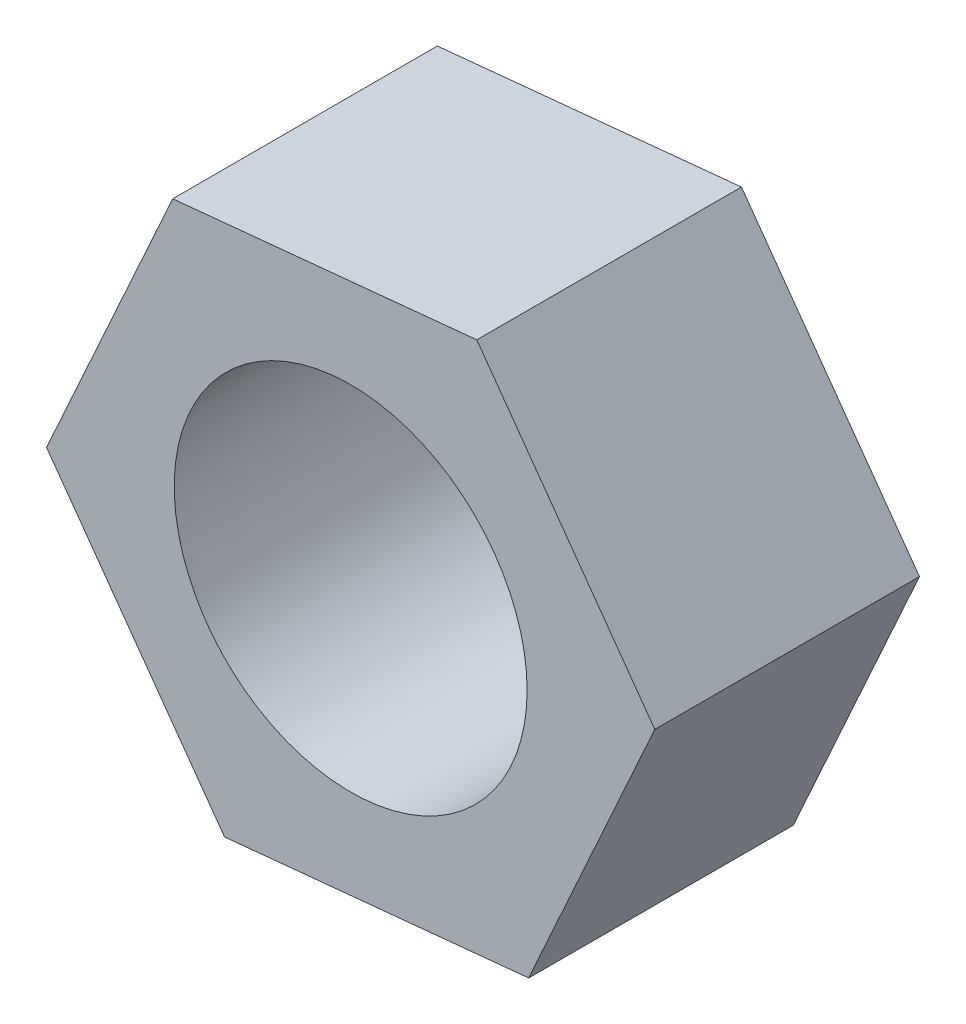
ISO-10303-21;
HEADER;
FILE_DESCRIPTION(('STEP AP214'),'2;1');
FILE_NAME('part.step','',(''),(''),'','','');
FILE_SCHEMA(('AUTOMOTIVE_DESIGN { 1 0 10303 214 1 1 1 1 }'));
ENDSEC;
DATA;
#1=APPLICATION_CONTEXT('core data for automotive mechanical design processes');
#2=APPLICATION_PROTOCOL_DEFINITION('international standard','automotive_design',2000,#1);
#3=PRODUCT_CONTEXT('',#1,'mechanical');
#4=PRODUCT('Part','Part','',(#3));
#5=PRODUCT_RELATED_PRODUCT_CATEGORY('part','',(#4));
#6=PRODUCT_DEFINITION_FORMATION('','',#4);
#7=PRODUCT_DEFINITION_CONTEXT('part definition',#1,'design');
#8=PRODUCT_DEFINITION('design','',#6,#7);
#9=PRODUCT_DEFINITION_SHAPE('','',#8);
#10=(LENGTH_UNIT() NAMED_UNIT(*) SI_UNIT(.MILLI.,.METRE.));
#11=(NAMED_UNIT(*) PLANE_ANGLE_UNIT() SI_UNIT($,.RADIAN.));
#12=(NAMED_UNIT(*) SI_UNIT($,.STERADIAN.) SOLID_ANGLE_UNIT());
#13=UNCERTAINTY_MEASURE_WITH_UNIT(LENGTH_MEASURE(1.E-05),#10,'distance_accuracy_value','');
#14=(GEOMETRIC_REPRESENTATION_CONTEXT(3) GLOBAL_UNCERTAINTY_ASSIGNED_CONTEXT((#13)) GLOBAL_UNIT_ASSIGNED_CONTEXT((#10,
#11,#12)) REPRESENTATION_CONTEXT('',''));
#15=CARTESIAN_POINT('',(0.,0.,0.));
#16=DIRECTION('',(0.,0.,1.));
#17=DIRECTION('',(1.,0.,0.));
#18=AXIS2_PLACEMENT_3D('',#15,#16,#17);
#19=CARTESIAN_POINT('',(0.,0.,15.));
#20=DIRECTION('',(0.,0.,1.));
#21=DIRECTION('',(1.,0.,0.));
#22=AXIS2_PLACEMENT_3D('',#19,#20,#21);
#23=PLANE('',#22);
#24=DIRECTION('',(0.99519247188162,0.0979384700214957,0.));
#25=VECTOR('',#24,1.);
#26=CARTESIAN_POINT('',(-7.14954257272269,-15.7760591086883,15.));
#27=LINE('',#26,#25);
#28=CARTESIAN_POINT('',(-7.14954257272269,-15.7760591086883,15.));
#29=VERTEX_POINT('',#28);
#30=CARTESIAN_POINT('',(10.0876966733676,-14.0797150477603,15.));
#31=VERTEX_POINT('',#30);
#32=EDGE_CURVE('E131',#29,#31,#27,.T.);
#33=ORIENTED_EDGE('',*,*,#32,.T.);
#34=DIRECTION('',(0.412779032894414,0.910831197315261,0.));
#35=VECTOR('',#34,1.);
#36=CARTESIAN_POINT('',(10.0876966733676,-14.0797150477603,15.));
#37=LINE('',#36,#35);
#38=CARTESIAN_POINT('',(17.2372392460903,1.69634406092792,15.));
#39=VERTEX_POINT('',#38);
#40=EDGE_CURVE('E89',#31,#39,#37,.T.);
#41=ORIENTED_EDGE('',*,*,#40,.T.);
#42=DIRECTION('',(-0.582413438987206,0.812892727293765,0.));
#43=VECTOR('',#42,1.);
#44=CARTESIAN_POINT('',(17.2372392460903,1.69634406092792,15.));
#45=LINE('',#44,#43);
#46=CARTESIAN_POINT('',(7.14954257272269,15.7760591086882,15.));
#47=VERTEX_POINT('',#46);
#48=EDGE_CURVE('E102',#39,#47,#45,.T.);
#49=ORIENTED_EDGE('',*,*,#48,.T.);
#50=DIRECTION('',(-0.99519247188162,-0.0979384700214954,0.));
#51=VECTOR('',#50,1.);
#52=CARTESIAN_POINT('',(7.14954257272269,15.7760591086882,15.));
#53=LINE('',#52,#51);
#54=CARTESIAN_POINT('',(-10.0876966733676,14.0797150477603,15.));
#55=VERTEX_POINT('',#54);
#56=EDGE_CURVE('E96',#47,#55,#53,.T.);
#57=ORIENTED_EDGE('',*,*,#56,.T.);
#58=DIRECTION('',(-0.412779032894414,-0.910831197315261,0.));
#59=VECTOR('',#58,1.);
#60=CARTESIAN_POINT('',(-10.0876966733676,14.0797150477603,15.));
#61=LINE('',#60,#59);
#62=CARTESIAN_POINT('',(-17.2372392460903,-1.69634406092792,15.));
#63=VERTEX_POINT('',#62);
#64=EDGE_CURVE('E100',#55,#63,#61,.T.);
#65=ORIENTED_EDGE('',*,*,#64,.T.);
#66=DIRECTION('',(0.582413438987206,-0.812892727293766,0.));
#67=VECTOR('',#66,1.);
#68=CARTESIAN_POINT('',(-17.2372392460903,-1.69634406092792,15.));
#69=LINE('',#68,#67);
#70=EDGE_CURVE('E52',#63,#29,#69,.T.);
#71=ORIENTED_EDGE('',*,*,#70,.T.);
#72=EDGE_LOOP('',(#33,#41,#49,#57,#65,#71));
#73=FACE_BOUND('',#72,.T.);
#74=CARTESIAN_POINT('',(0.,0.,15.));
#75=DIRECTION('',(0.,0.,1.));
#76=DIRECTION('',(1.,0.,0.));
#77=AXIS2_PLACEMENT_3D('',#74,#75,#76);
#78=CIRCLE('',#77,10.);
#79=CARTESIAN_POINT('',(10.,0.,15.));
#80=VERTEX_POINT('',#79);
#81=EDGE_CURVE('E124',#80,#80,#78,.T.);
#82=ORIENTED_EDGE('',*,*,#81,.F.);
#83=EDGE_LOOP('',(#82));
#84=FACE_BOUND('',#83,.T.);
#85=ADVANCED_FACE('F35',(#73,#84),#23,.T.);
#86=CARTESIAN_POINT('',(0.,0.,0.));
#87=DIRECTION('',(0.,0.,1.));
#88=DIRECTION('',(1.,0.,0.));
#89=AXIS2_PLACEMENT_3D('',#86,#87,#88);
#90=PLANE('',#89);
#91=DIRECTION('',(0.99519247188162,0.0979384700214957,0.));
#92=VECTOR('',#91,1.);
#93=CARTESIAN_POINT('',(-7.14954257272269,-15.7760591086883,0.));
#94=LINE('',#93,#92);
#95=CARTESIAN_POINT('',(-7.14954257272269,-15.7760591086883,0.));
#96=VERTEX_POINT('',#95);
#97=CARTESIAN_POINT('',(10.0876966733676,-14.0797150477603,0.));
#98=VERTEX_POINT('',#97);
#99=EDGE_CURVE('E120',#96,#98,#94,.T.);
#100=ORIENTED_EDGE('',*,*,#99,.F.);
#101=DIRECTION('',(0.582413438987206,-0.812892727293766,0.));
#102=VECTOR('',#101,1.);
#103=CARTESIAN_POINT('',(-17.2372392460903,-1.69634406092792,0.));
#104=LINE('',#103,#102);
#105=CARTESIAN_POINT('',(-17.2372392460903,-1.69634406092792,0.));
#106=VERTEX_POINT('',#105);
#107=EDGE_CURVE('E81',#106,#96,#104,.T.);
#108=ORIENTED_EDGE('',*,*,#107,.F.);
#109=DIRECTION('',(-0.412779032894414,-0.910831197315261,0.));
#110=VECTOR('',#109,1.);
#111=CARTESIAN_POINT('',(-10.0876966733676,14.0797150477603,0.));
#112=LINE('',#111,#110);
#113=CARTESIAN_POINT('',(-10.0876966733676,14.0797150477603,0.));
#114=VERTEX_POINT('',#113);
#115=EDGE_CURVE('E75',#114,#106,#112,.T.);
#116=ORIENTED_EDGE('',*,*,#115,.F.);
#117=DIRECTION('',(-0.99519247188162,-0.0979384700214954,0.));
#118=VECTOR('',#117,1.);
#119=CARTESIAN_POINT('',(7.14954257272269,15.7760591086882,0.));
#120=LINE('',#119,#118);
#121=CARTESIAN_POINT('',(7.14954257272269,15.7760591086882,0.));
#122=VERTEX_POINT('',#121);
#123=EDGE_CURVE('E110',#122,#114,#120,.T.);
#124=ORIENTED_EDGE('',*,*,#123,.F.);
#125=DIRECTION('',(-0.582413438987206,0.812892727293765,0.));
#126=VECTOR('',#125,1.);
#127=CARTESIAN_POINT('',(17.2372392460903,1.69634406092792,0.));
#128=LINE('',#127,#126);
#129=CARTESIAN_POINT('',(17.2372392460903,1.69634406092792,0.));
#130=VERTEX_POINT('',#129);
#131=EDGE_CURVE('E126',#130,#122,#128,.T.);
#132=ORIENTED_EDGE('',*,*,#131,.F.);
#133=DIRECTION('',(0.412779032894414,0.910831197315261,0.));
#134=VECTOR('',#133,1.);
#135=CARTESIAN_POINT('',(10.0876966733676,-14.0797150477603,0.));
#136=LINE('',#135,#134);
#137=EDGE_CURVE('E123',#98,#130,#136,.T.);
#138=ORIENTED_EDGE('',*,*,#137,.F.);
#139=EDGE_LOOP('',(#100,#108,#116,#124,#132,#138));
#140=FACE_BOUND('',#139,.T.);
#141=CARTESIAN_POINT('',(0.,0.,0.));
#142=DIRECTION('',(0.,0.,1.));
#143=DIRECTION('',(1.,0.,0.));
#144=AXIS2_PLACEMENT_3D('',#141,#142,#143);
#145=CIRCLE('',#144,10.);
#146=CARTESIAN_POINT('',(10.,0.,0.));
#147=VERTEX_POINT('',#146);
#148=EDGE_CURVE('E224',#147,#147,#145,.T.);
#149=ORIENTED_EDGE('',*,*,#148,.T.);
#150=EDGE_LOOP('',(#149));
#151=FACE_BOUND('',#150,.T.);
#152=ADVANCED_FACE('F140',(#140,#151),#90,.F.);
#153=CARTESIAN_POINT('',(-7.14954257272269,-15.7760591086883,15.));
#154=DIRECTION('',(-0.0979384700214957,0.99519247188162,0.));
#155=DIRECTION('',(-0.99519247188162,-0.0979384700214958,0.));
#156=AXIS2_PLACEMENT_3D('',#153,#154,#155);
#157=PLANE('',#156);
#158=ORIENTED_EDGE('',*,*,#99,.T.);
#159=DIRECTION('',(0.,0.,-1.));
#160=VECTOR('',#159,1.);
#161=CARTESIAN_POINT('',(10.0876966733676,-14.0797150477603,15.));
#162=LINE('',#161,#160);
#163=EDGE_CURVE('E11',#31,#98,#162,.T.);
#164=ORIENTED_EDGE('',*,*,#163,.F.);
#165=ORIENTED_EDGE('',*,*,#32,.F.);
#166=DIRECTION('',(0.,0.,-1.));
#167=VECTOR('',#166,1.);
#168=CARTESIAN_POINT('',(-7.14954257272269,-15.7760591086883,15.));
#169=LINE('',#168,#167);
#170=EDGE_CURVE('E116',#29,#96,#169,.T.);
#171=ORIENTED_EDGE('',*,*,#170,.T.);
#172=EDGE_LOOP('',(#158,#164,#165,#171));
#173=FACE_BOUND('',#172,.T.);
#174=ADVANCED_FACE('F37',(#173),#157,.F.);
#175=CARTESIAN_POINT('',(10.0876966733676,-14.0797150477603,15.));
#176=DIRECTION('',(-0.910831197315261,0.412779032894414,0.));
#177=DIRECTION('',(-0.412779032894414,-0.910831197315261,0.));
#178=AXIS2_PLACEMENT_3D('',#175,#176,#177);
#179=PLANE('',#178);
#180=ORIENTED_EDGE('',*,*,#137,.T.);
#181=DIRECTION('',(0.,0.,-1.));
#182=VECTOR('',#181,1.);
#183=CARTESIAN_POINT('',(17.2372392460903,1.69634406092792,15.));
#184=LINE('',#183,#182);
#185=EDGE_CURVE('E44',#39,#130,#184,.T.);
#186=ORIENTED_EDGE('',*,*,#185,.F.);
#187=ORIENTED_EDGE('',*,*,#40,.F.);
#188=ORIENTED_EDGE('',*,*,#163,.T.);
#189=EDGE_LOOP('',(#180,#186,#187,#188));
#190=FACE_BOUND('',#189,.T.);
#191=ADVANCED_FACE('F165',(#190),#179,.F.);
#192=CARTESIAN_POINT('',(17.2372392460903,1.69634406092792,15.));
#193=DIRECTION('',(-0.812892727293765,-0.582413438987206,0.));
#194=DIRECTION('',(0.582413438987206,-0.812892727293765,0.));
#195=AXIS2_PLACEMENT_3D('',#192,#193,#194);
#196=PLANE('',#195);
#197=ORIENTED_EDGE('',*,*,#131,.T.);
#198=DIRECTION('',(0.,0.,-1.));
#199=VECTOR('',#198,1.);
#200=CARTESIAN_POINT('',(7.14954257272269,15.7760591086882,15.));
#201=LINE('',#200,#199);
#202=EDGE_CURVE('E111',#47,#122,#201,.T.);
#203=ORIENTED_EDGE('',*,*,#202,.F.);
#204=ORIENTED_EDGE('',*,*,#48,.F.);
#205=ORIENTED_EDGE('',*,*,#185,.T.);
#206=EDGE_LOOP('',(#197,#203,#204,#205));
#207=FACE_BOUND('',#206,.T.);
#208=ADVANCED_FACE('F137',(#207),#196,.F.);
#209=CARTESIAN_POINT('',(7.14954257272269,15.7760591086882,15.));
#210=DIRECTION('',(0.0979384700214954,-0.99519247188162,0.));
#211=DIRECTION('',(0.99519247188162,0.0979384700214954,0.));
#212=AXIS2_PLACEMENT_3D('',#209,#210,#211);
#213=PLANE('',#212);
#214=ORIENTED_EDGE('',*,*,#123,.T.);
#215=DIRECTION('',(0.,0.,-1.));
#216=VECTOR('',#215,1.);
#217=CARTESIAN_POINT('',(-10.0876966733676,14.0797150477603,15.));
#218=LINE('',#217,#216);
#219=EDGE_CURVE('E107',#55,#114,#218,.T.);
#220=ORIENTED_EDGE('',*,*,#219,.F.);
#221=ORIENTED_EDGE('',*,*,#56,.F.);
#222=ORIENTED_EDGE('',*,*,#202,.T.);
#223=EDGE_LOOP('',(#214,#220,#221,#222));
#224=FACE_BOUND('',#223,.T.);
#225=ADVANCED_FACE('F108',(#224),#213,.F.);
#226=CARTESIAN_POINT('',(-10.0876966733676,14.0797150477603,15.));
#227=DIRECTION('',(0.910831197315261,-0.412779032894414,0.));
#228=DIRECTION('',(0.412779032894414,0.910831197315261,0.));
#229=AXIS2_PLACEMENT_3D('',#226,#227,#228);
#230=PLANE('',#229);
#231=ORIENTED_EDGE('',*,*,#115,.T.);
#232=DIRECTION('',(0.,0.,-1.));
#233=VECTOR('',#232,1.);
#234=CARTESIAN_POINT('',(-17.2372392460903,-1.69634406092792,15.));
#235=LINE('',#234,#233);
#236=EDGE_CURVE('E112',#63,#106,#235,.T.);
#237=ORIENTED_EDGE('',*,*,#236,.F.);
#238=ORIENTED_EDGE('',*,*,#64,.F.);
#239=ORIENTED_EDGE('',*,*,#219,.T.);
#240=EDGE_LOOP('',(#231,#237,#238,#239));
#241=FACE_BOUND('',#240,.T.);
#242=ADVANCED_FACE('F114',(#241),#230,.F.);
#243=CARTESIAN_POINT('',(-17.2372392460903,-1.69634406092792,15.));
#244=DIRECTION('',(0.812892727293766,0.582413438987206,0.));
#245=DIRECTION('',(-0.582413438987206,0.812892727293766,0.));
#246=AXIS2_PLACEMENT_3D('',#243,#244,#245);
#247=PLANE('',#246);
#248=ORIENTED_EDGE('',*,*,#107,.T.);
#249=ORIENTED_EDGE('',*,*,#170,.F.);
#250=ORIENTED_EDGE('',*,*,#70,.F.);
#251=ORIENTED_EDGE('',*,*,#236,.T.);
#252=EDGE_LOOP('',(#248,#249,#250,#251));
#253=FACE_BOUND('',#252,.T.);
#254=ADVANCED_FACE('F145',(#253),#247,.F.);
#255=CARTESIAN_POINT('',(0.,0.,15.));
#256=DIRECTION('',(0.,0.,-1.));
#257=DIRECTION('',(-1.,0.,0.));
#258=AXIS2_PLACEMENT_3D('',#255,#256,#257);
#259=CYLINDRICAL_SURFACE('',#258,10.);
#260=ORIENTED_EDGE('',*,*,#81,.T.);
#261=EDGE_LOOP('',(#260));
#262=FACE_BOUND('',#261,.T.);
#263=ORIENTED_EDGE('',*,*,#148,.F.);
#264=EDGE_LOOP('',(#263));
#265=FACE_BOUND('',#264,.T.);
#266=ADVANCED_FACE('F147',(#262,#265),#259,.F.);
#267=CLOSED_SHELL('',(#85,#152,#174,#191,#208,#225,#242,#254,#266));
#268=MANIFOLD_SOLID_BREP('B2',#267);
#269=ADVANCED_BREP_SHAPE_REPRESENTATION('',(#18,#268),#14);
#270=SHAPE_DEFINITION_REPRESENTATION(#9,#269);
ENDSEC;
END-ISO-10303-21;
